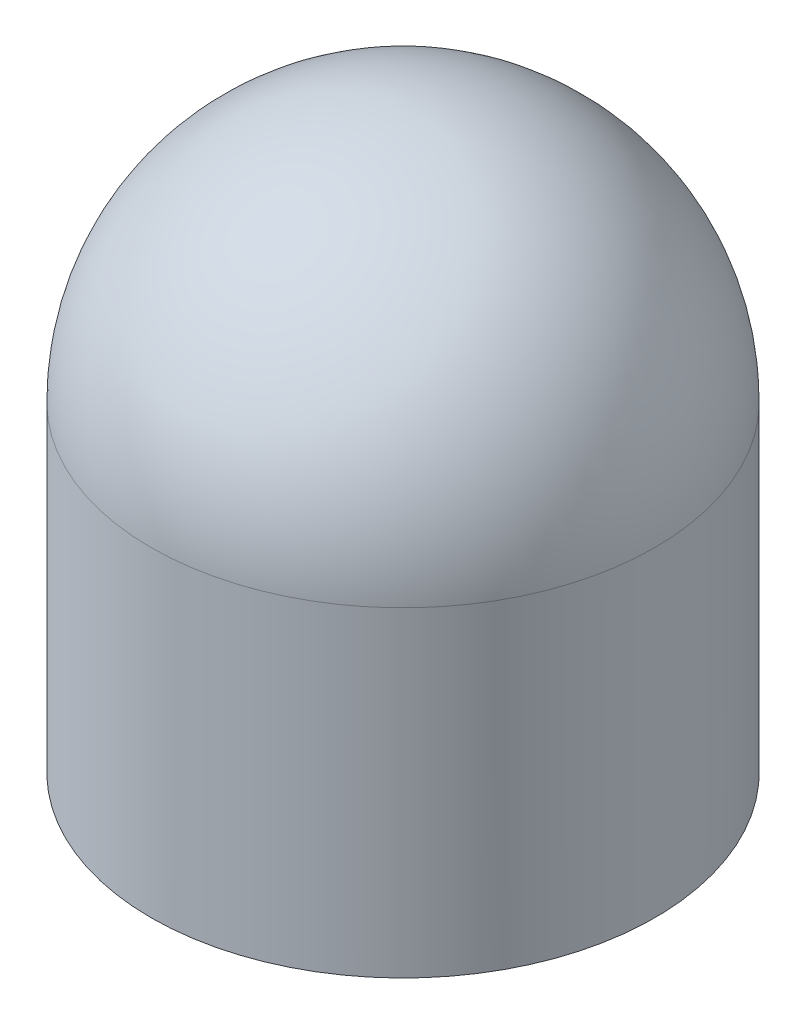
ISO-10303-21;
HEADER;
FILE_DESCRIPTION(('STEP AP214'),'2;1');
FILE_NAME('part.step','',(''),(''),'','','');
FILE_SCHEMA(('AUTOMOTIVE_DESIGN { 1 0 10303 214 1 1 1 1 }'));
ENDSEC;
DATA;
#1=APPLICATION_CONTEXT('core data for automotive mechanical design processes');
#2=APPLICATION_PROTOCOL_DEFINITION('international standard','automotive_design',2000,#1);
#3=PRODUCT_CONTEXT('',#1,'mechanical');
#4=PRODUCT('Part','Part','',(#3));
#5=PRODUCT_RELATED_PRODUCT_CATEGORY('part','',(#4));
#6=PRODUCT_DEFINITION_FORMATION('','',#4);
#7=PRODUCT_DEFINITION_CONTEXT('part definition',#1,'design');
#8=PRODUCT_DEFINITION('design','',#6,#7);
#9=PRODUCT_DEFINITION_SHAPE('','',#8);
#10=(LENGTH_UNIT() NAMED_UNIT(*) SI_UNIT(.MILLI.,.METRE.));
#11=(NAMED_UNIT(*) PLANE_ANGLE_UNIT() SI_UNIT($,.RADIAN.));
#12=(NAMED_UNIT(*) SI_UNIT($,.STERADIAN.) SOLID_ANGLE_UNIT());
#13=UNCERTAINTY_MEASURE_WITH_UNIT(LENGTH_MEASURE(1.E-05),#10,'distance_accuracy_value','');
#14=(GEOMETRIC_REPRESENTATION_CONTEXT(3) GLOBAL_UNCERTAINTY_ASSIGNED_CONTEXT((#13)) GLOBAL_UNIT_ASSIGNED_CONTEXT((#10,
#11,#12)) REPRESENTATION_CONTEXT('',''));
#15=CARTESIAN_POINT('',(0.,0.,0.));
#16=DIRECTION('',(0.,0.,1.));
#17=DIRECTION('',(1.,0.,0.));
#18=AXIS2_PLACEMENT_3D('',#15,#16,#17);
#19=CARTESIAN_POINT('',(0.,146.05,0.));
#20=DIRECTION('',(0.,1.,0.));
#21=DIRECTION('',(0.,0.,1.));
#22=AXIS2_PLACEMENT_3D('',#19,#20,#21);
#23=CYLINDRICAL_SURFACE('',#22,69.85);
#24=CARTESIAN_POINT('',(0.,76.2,0.));
#25=DIRECTION('',(0.,1.,0.));
#26=DIRECTION('',(0.,0.,1.));
#27=AXIS2_PLACEMENT_3D('',#24,#25,#26);
#28=CIRCLE('',#27,69.85);
#29=CARTESIAN_POINT('',(0.,76.2,69.85));
#30=VERTEX_POINT('',#29);
#31=EDGE_CURVE('E44',#30,#30,#28,.T.);
#32=ORIENTED_EDGE('',*,*,#31,.F.);
#33=EDGE_LOOP('',(#32));
#34=FACE_BOUND('',#33,.T.);
#35=CARTESIAN_POINT('',(0.,-12.7,0.));
#36=DIRECTION('',(0.,1.,0.));
#37=DIRECTION('',(0.,0.,1.));
#38=AXIS2_PLACEMENT_3D('',#35,#36,#37);
#39=CIRCLE('',#38,69.85);
#40=CARTESIAN_POINT('',(0.,-12.7,69.85));
#41=VERTEX_POINT('',#40);
#42=EDGE_CURVE('E56',#41,#41,#39,.T.);
#43=ORIENTED_EDGE('',*,*,#42,.T.);
#44=EDGE_LOOP('',(#43));
#45=FACE_BOUND('',#44,.T.);
#46=ADVANCED_FACE('F33',(#34,#45),#23,.T.);
#47=CARTESIAN_POINT('',(0.,76.2,0.));
#48=DIRECTION('',(0.,1.,0.));
#49=DIRECTION('',(1.,0.,0.));
#50=AXIS2_PLACEMENT_3D('',#47,#48,#49);
#51=SPHERICAL_SURFACE('',#50,69.85);
#52=ORIENTED_EDGE('',*,*,#31,.T.);
#53=EDGE_LOOP('',(#52));
#54=FACE_BOUND('',#53,.T.);
#55=ADVANCED_FACE('F78',(#54),#51,.T.);
#56=CARTESIAN_POINT('',(0.,-12.7,0.));
#57=DIRECTION('',(0.,-1.,0.));
#58=DIRECTION('',(0.,0.,-1.));
#59=AXIS2_PLACEMENT_3D('',#56,#57,#58);
#60=PLANE('',#59);
#61=CARTESIAN_POINT('',(0.,-12.7,0.));
#62=DIRECTION('',(0.,-1.,0.));
#63=DIRECTION('',(0.,0.,-1.));
#64=AXIS2_PLACEMENT_3D('',#61,#62,#63);
#65=CIRCLE('',#64,67.0610603879154);
#66=CARTESIAN_POINT('',(0.,-12.7,-67.0610603879154));
#67=VERTEX_POINT('',#66);
#68=EDGE_CURVE('E10',#67,#67,#65,.F.);
#69=ORIENTED_EDGE('',*,*,#68,.T.);
#70=EDGE_LOOP('',(#69));
#71=FACE_BOUND('',#70,.T.);
#72=ORIENTED_EDGE('',*,*,#42,.F.);
#73=EDGE_LOOP('',(#72));
#74=FACE_BOUND('',#73,.T.);
#75=ADVANCED_FACE('F69',(#71,#74),#60,.T.);
#76=CARTESIAN_POINT('',(0.,-12.7,0.));
#77=DIRECTION('',(0.,1.,0.));
#78=DIRECTION('',(0.,0.,1.));
#79=AXIS2_PLACEMENT_3D('',#76,#77,#78);
#80=CYLINDRICAL_SURFACE('',#79,66.2673103879154);
#81=CARTESIAN_POINT('',(0.,-11.90625,0.));
#82=DIRECTION('',(0.,-1.,0.));
#83=DIRECTION('',(0.,0.,-1.));
#84=AXIS2_PLACEMENT_3D('',#81,#82,#83);
#85=CIRCLE('',#84,66.2673103879154);
#86=CARTESIAN_POINT('',(0.,-11.90625,-66.2673103879154));
#87=VERTEX_POINT('',#86);
#88=EDGE_CURVE('E40',#87,#87,#85,.T.);
#89=ORIENTED_EDGE('',*,*,#88,.T.);
#90=EDGE_LOOP('',(#89));
#91=FACE_BOUND('',#90,.T.);
#92=CARTESIAN_POINT('',(0.,0.,0.));
#93=DIRECTION('',(0.,-1.,0.));
#94=DIRECTION('',(0.,0.,-1.));
#95=AXIS2_PLACEMENT_3D('',#92,#93,#94);
#96=CIRCLE('',#95,66.2673103879154);
#97=CARTESIAN_POINT('',(0.,0.,-66.2673103879154));
#98=VERTEX_POINT('',#97);
#99=EDGE_CURVE('E59',#98,#98,#96,.T.);
#100=ORIENTED_EDGE('',*,*,#99,.F.);
#101=EDGE_LOOP('',(#100));
#102=FACE_BOUND('',#101,.T.);
#103=ADVANCED_FACE('F66',(#91,#102),#80,.F.);
#104=CARTESIAN_POINT('',(0.,76.2,0.));
#105=DIRECTION('',(0.,1.,0.));
#106=DIRECTION('',(1.,0.,0.));
#107=AXIS2_PLACEMENT_3D('',#104,#105,#106);
#108=SPHERICAL_SURFACE('',#107,63.5);
#109=CARTESIAN_POINT('',(0.,76.2,0.));
#110=DIRECTION('',(0.,1.,0.));
#111=DIRECTION('',(0.,0.,1.));
#112=AXIS2_PLACEMENT_3D('',#109,#110,#111);
#113=CIRCLE('',#112,63.5);
#114=CARTESIAN_POINT('',(0.,76.2,63.5));
#115=VERTEX_POINT('',#114);
#116=EDGE_CURVE('E48',#115,#115,#113,.T.);
#117=ORIENTED_EDGE('',*,*,#116,.F.);
#118=EDGE_LOOP('',(#117));
#119=FACE_BOUND('',#118,.T.);
#120=ADVANCED_FACE('F68',(#119),#108,.F.);
#121=CARTESIAN_POINT('',(0.,146.05,0.));
#122=DIRECTION('',(0.,1.,0.));
#123=DIRECTION('',(0.,0.,1.));
#124=AXIS2_PLACEMENT_3D('',#121,#122,#123);
#125=CYLINDRICAL_SURFACE('',#124,63.5);
#126=CARTESIAN_POINT('',(0.,0.,0.));
#127=DIRECTION('',(0.,1.,0.));
#128=DIRECTION('',(0.,0.,1.));
#129=AXIS2_PLACEMENT_3D('',#126,#127,#128);
#130=CIRCLE('',#129,63.5);
#131=CARTESIAN_POINT('',(0.,0.,63.5));
#132=VERTEX_POINT('',#131);
#133=EDGE_CURVE('E53',#132,#132,#130,.T.);
#134=ORIENTED_EDGE('',*,*,#133,.F.);
#135=EDGE_LOOP('',(#134));
#136=FACE_BOUND('',#135,.T.);
#137=ORIENTED_EDGE('',*,*,#116,.T.);
#138=EDGE_LOOP('',(#137));
#139=FACE_BOUND('',#138,.T.);
#140=ADVANCED_FACE('F75',(#136,#139),#125,.F.);
#141=CARTESIAN_POINT('',(0.,0.,0.));
#142=DIRECTION('',(0.,1.,0.));
#143=DIRECTION('',(0.,0.,1.));
#144=AXIS2_PLACEMENT_3D('',#141,#142,#143);
#145=PLANE('',#144);
#146=ORIENTED_EDGE('',*,*,#99,.T.);
#147=EDGE_LOOP('',(#146));
#148=FACE_BOUND('',#147,.T.);
#149=ORIENTED_EDGE('',*,*,#133,.T.);
#150=EDGE_LOOP('',(#149));
#151=FACE_BOUND('',#150,.T.);
#152=ADVANCED_FACE('F63',(#148,#151),#145,.F.);
#153=CARTESIAN_POINT('',(0.,-11.90625,0.));
#154=DIRECTION('',(0.,-1.,0.));
#155=DIRECTION('',(0.,0.,-1.));
#156=AXIS2_PLACEMENT_3D('',#153,#154,#155);
#157=TOROIDAL_SURFACE('',#156,67.0610603879154,0.79375);
#158=ORIENTED_EDGE('',*,*,#68,.F.);
#159=EDGE_LOOP('',(#158));
#160=FACE_BOUND('',#159,.T.);
#161=ORIENTED_EDGE('',*,*,#88,.F.);
#162=EDGE_LOOP('',(#161));
#163=FACE_BOUND('',#162,.T.);
#164=ADVANCED_FACE('F35',(#160,#163),#157,.T.);
#165=CLOSED_SHELL('',(#46,#55,#75,#103,#120,#140,#152,#164));
#166=MANIFOLD_SOLID_BREP('B2',#165);
#167=ADVANCED_BREP_SHAPE_REPRESENTATION('',(#18,#166),#14);
#168=SHAPE_DEFINITION_REPRESENTATION(#9,#167);
ENDSEC;
END-ISO-10303-21;
